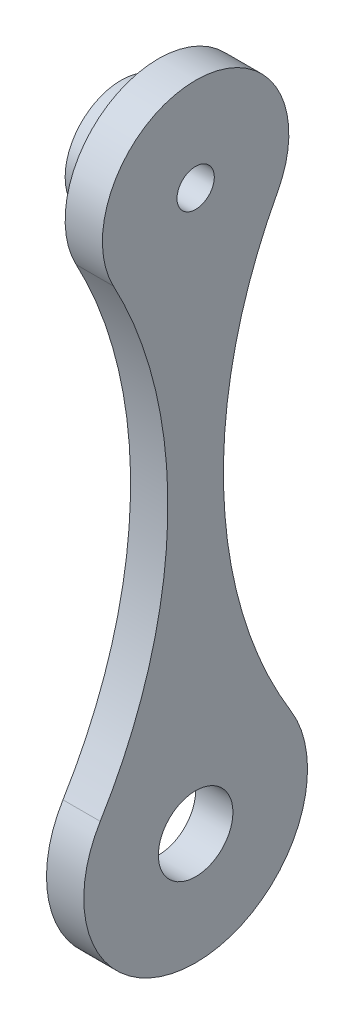
ISO-10303-21;
HEADER;
FILE_DESCRIPTION(('STEP AP214'),'2;1');
FILE_NAME('part.step','',(''),(''),'','','');
FILE_SCHEMA(('AUTOMOTIVE_DESIGN { 1 0 10303 214 1 1 1 1 }'));
ENDSEC;
DATA;
#1=APPLICATION_CONTEXT('core data for automotive mechanical design processes');
#2=APPLICATION_PROTOCOL_DEFINITION('international standard','automotive_design',2000,#1);
#3=PRODUCT_CONTEXT('',#1,'mechanical');
#4=PRODUCT('Part','Part','',(#3));
#5=PRODUCT_RELATED_PRODUCT_CATEGORY('part','',(#4));
#6=PRODUCT_DEFINITION_FORMATION('','',#4);
#7=PRODUCT_DEFINITION_CONTEXT('part definition',#1,'design');
#8=PRODUCT_DEFINITION('design','',#6,#7);
#9=PRODUCT_DEFINITION_SHAPE('','',#8);
#10=(LENGTH_UNIT() NAMED_UNIT(*) SI_UNIT(.MILLI.,.METRE.));
#11=(NAMED_UNIT(*) PLANE_ANGLE_UNIT() SI_UNIT($,.RADIAN.));
#12=(NAMED_UNIT(*) SI_UNIT($,.STERADIAN.) SOLID_ANGLE_UNIT());
#13=UNCERTAINTY_MEASURE_WITH_UNIT(LENGTH_MEASURE(1.E-05),#10,'distance_accuracy_value','');
#14=(GEOMETRIC_REPRESENTATION_CONTEXT(3) GLOBAL_UNCERTAINTY_ASSIGNED_CONTEXT((#13)) GLOBAL_UNIT_ASSIGNED_CONTEXT((#10,
#11,#12)) REPRESENTATION_CONTEXT('',''));
#15=CARTESIAN_POINT('',(0.,0.,0.));
#16=DIRECTION('',(0.,0.,1.));
#17=DIRECTION('',(1.,0.,0.));
#18=AXIS2_PLACEMENT_3D('',#15,#16,#17);
#19=CARTESIAN_POINT('',(10.,-80.,0.));
#20=DIRECTION('',(-1.,0.,0.));
#21=DIRECTION('',(0.,0.,1.));
#22=AXIS2_PLACEMENT_3D('',#19,#20,#21);
#23=CYLINDRICAL_SURFACE('',#22,25.);
#24=CARTESIAN_POINT('',(0.,-80.,0.));
#25=DIRECTION('',(1.,0.,0.));
#26=DIRECTION('',(0.,0.,-1.));
#27=AXIS2_PLACEMENT_3D('',#24,#25,#26);
#28=CIRCLE('',#27,25.);
#29=CARTESIAN_POINT('',(0.,-91.7990522807326,-22.0404710765569));
#30=VERTEX_POINT('',#29);
#31=CARTESIAN_POINT('',(0.,-91.7990522807326,22.0404710765569));
#32=VERTEX_POINT('',#31);
#33=EDGE_CURVE('E130',#30,#32,#28,.T.);
#34=ORIENTED_EDGE('',*,*,#33,.T.);
#35=DIRECTION('',(-1.,0.,0.));
#36=VECTOR('',#35,1.);
#37=CARTESIAN_POINT('',(10.,-91.7990522807326,22.0404710765569));
#38=LINE('',#37,#36);
#39=CARTESIAN_POINT('',(10.,-91.7990522807326,22.0404710765569));
#40=VERTEX_POINT('',#39);
#41=EDGE_CURVE('E128',#40,#32,#38,.T.);
#42=ORIENTED_EDGE('',*,*,#41,.F.);
#43=CARTESIAN_POINT('',(10.,-80.,0.));
#44=DIRECTION('',(1.,0.,0.));
#45=DIRECTION('',(0.,0.,-1.));
#46=AXIS2_PLACEMENT_3D('',#43,#44,#45);
#47=CIRCLE('',#46,25.);
#48=CARTESIAN_POINT('',(10.,-91.7990522807326,-22.0404710765569));
#49=VERTEX_POINT('',#48);
#50=EDGE_CURVE('E118',#49,#40,#47,.T.);
#51=ORIENTED_EDGE('',*,*,#50,.F.);
#52=DIRECTION('',(-1.,0.,0.));
#53=VECTOR('',#52,1.);
#54=CARTESIAN_POINT('',(10.,-91.7990522807326,-22.0404710765569));
#55=LINE('',#54,#53);
#56=EDGE_CURVE('E83',#49,#30,#55,.T.);
#57=ORIENTED_EDGE('',*,*,#56,.T.);
#58=EDGE_LOOP('',(#34,#42,#51,#57));
#59=FACE_BOUND('',#58,.T.);
#60=ADVANCED_FACE('F74',(#59),#23,.T.);
#61=CARTESIAN_POINT('',(10.,-149.97456329341,130.711543746744));
#62=DIRECTION('',(-1.,0.,0.));
#63=DIRECTION('',(0.,0.,1.));
#64=AXIS2_PLACEMENT_3D('',#61,#62,#63);
#65=CYLINDRICAL_SURFACE('',#64,123.263101197703);
#66=CARTESIAN_POINT('',(0.,-149.97456329341,130.711543746744));
#67=DIRECTION('',(1.,0.,0.));
#68=DIRECTION('',(0.,0.,-1.));
#69=AXIS2_PLACEMENT_3D('',#66,#67,#68);
#70=CIRCLE('',#69,123.263101197703);
#71=CARTESIAN_POINT('',(0.,-214.335674520243,25.5857168604721));
#72=VERTEX_POINT('',#71);
#73=EDGE_CURVE('E145',#32,#72,#70,.F.);
#74=ORIENTED_EDGE('',*,*,#73,.T.);
#75=DIRECTION('',(-1.,0.,0.));
#76=VECTOR('',#75,1.);
#77=CARTESIAN_POINT('',(10.,-214.335674520243,25.5857168604721));
#78=LINE('',#77,#76);
#79=CARTESIAN_POINT('',(10.,-214.335674520243,25.5857168604721));
#80=VERTEX_POINT('',#79);
#81=EDGE_CURVE('E105',#80,#72,#78,.T.);
#82=ORIENTED_EDGE('',*,*,#81,.F.);
#83=CARTESIAN_POINT('',(10.,-149.97456329341,130.711543746744));
#84=DIRECTION('',(1.,0.,0.));
#85=DIRECTION('',(0.,0.,-1.));
#86=AXIS2_PLACEMENT_3D('',#83,#84,#85);
#87=CIRCLE('',#86,123.263101197703);
#88=EDGE_CURVE('E123',#40,#80,#87,.F.);
#89=ORIENTED_EDGE('',*,*,#88,.F.);
#90=ORIENTED_EDGE('',*,*,#41,.T.);
#91=EDGE_LOOP('',(#74,#82,#89,#90));
#92=FACE_BOUND('',#91,.T.);
#93=ADVANCED_FACE('F135',(#92),#65,.F.);
#94=CARTESIAN_POINT('',(10.,-149.97456329341,-130.711543746744));
#95=DIRECTION('',(-1.,0.,0.));
#96=DIRECTION('',(0.,0.,1.));
#97=AXIS2_PLACEMENT_3D('',#94,#95,#96);
#98=CYLINDRICAL_SURFACE('',#97,123.263101197703);
#99=CARTESIAN_POINT('',(0.,-149.97456329341,-130.711543746744));
#100=DIRECTION('',(1.,0.,0.));
#101=DIRECTION('',(0.,0.,-1.));
#102=AXIS2_PLACEMENT_3D('',#99,#100,#101);
#103=CIRCLE('',#102,123.263101197703);
#104=CARTESIAN_POINT('',(0.,-214.335674520243,-25.5857168604721));
#105=VERTEX_POINT('',#104);
#106=EDGE_CURVE('E140',#30,#105,#103,.T.);
#107=ORIENTED_EDGE('',*,*,#106,.F.);
#108=ORIENTED_EDGE('',*,*,#56,.F.);
#109=CARTESIAN_POINT('',(10.,-149.97456329341,-130.711543746744));
#110=DIRECTION('',(1.,0.,0.));
#111=DIRECTION('',(0.,0.,-1.));
#112=AXIS2_PLACEMENT_3D('',#109,#110,#111);
#113=CIRCLE('',#112,123.263101197703);
#114=CARTESIAN_POINT('',(10.,-214.335674520243,-25.5857168604721));
#115=VERTEX_POINT('',#114);
#116=EDGE_CURVE('E124',#49,#115,#113,.T.);
#117=ORIENTED_EDGE('',*,*,#116,.T.);
#118=DIRECTION('',(-1.,0.,0.));
#119=VECTOR('',#118,1.);
#120=CARTESIAN_POINT('',(10.,-214.335674520243,-25.5857168604721));
#121=LINE('',#120,#119);
#122=EDGE_CURVE('E91',#115,#105,#121,.T.);
#123=ORIENTED_EDGE('',*,*,#122,.T.);
#124=EDGE_LOOP('',(#107,#108,#117,#123));
#125=FACE_BOUND('',#124,.T.);
#126=ADVANCED_FACE('F160',(#125),#98,.F.);
#127=CARTESIAN_POINT('',(0.,0.,0.));
#128=DIRECTION('',(1.,0.,0.));
#129=DIRECTION('',(0.,0.,-1.));
#130=AXIS2_PLACEMENT_3D('',#127,#128,#129);
#131=PLANE('',#130);
#132=CARTESIAN_POINT('',(0.,-80.,0.));
#133=DIRECTION('',(1.,0.,0.));
#134=DIRECTION('',(0.,0.,-1.));
#135=AXIS2_PLACEMENT_3D('',#132,#133,#134);
#136=CIRCLE('',#135,15.);
#137=CARTESIAN_POINT('',(0.,-80.,-15.));
#138=VERTEX_POINT('',#137);
#139=EDGE_CURVE('E12',#138,#138,#136,.F.);
#140=ORIENTED_EDGE('',*,*,#139,.F.);
#141=EDGE_LOOP('',(#140));
#142=FACE_BOUND('',#141,.T.);
#143=ORIENTED_EDGE('',*,*,#106,.T.);
#144=CARTESIAN_POINT('',(0.,-230.,0.));
#145=DIRECTION('',(1.,0.,0.));
#146=DIRECTION('',(0.,0.,-1.));
#147=AXIS2_PLACEMENT_3D('',#144,#145,#146);
#148=CIRCLE('',#147,30.);
#149=EDGE_CURVE('E152',#72,#105,#148,.T.);
#150=ORIENTED_EDGE('',*,*,#149,.F.);
#151=ORIENTED_EDGE('',*,*,#73,.F.);
#152=ORIENTED_EDGE('',*,*,#33,.F.);
#153=EDGE_LOOP('',(#143,#150,#151,#152));
#154=FACE_BOUND('',#153,.T.);
#155=CARTESIAN_POINT('',(0.,-230.,0.));
#156=DIRECTION('',(1.,0.,0.));
#157=DIRECTION('',(0.,0.,-1.));
#158=AXIS2_PLACEMENT_3D('',#155,#156,#157);
#159=CIRCLE('',#158,10.);
#160=CARTESIAN_POINT('',(0.,-230.,-10.));
#161=VERTEX_POINT('',#160);
#162=EDGE_CURVE('E153',#161,#161,#159,.T.);
#163=ORIENTED_EDGE('',*,*,#162,.T.);
#164=EDGE_LOOP('',(#163));
#165=FACE_BOUND('',#164,.T.);
#166=ADVANCED_FACE('F158',(#142,#154,#165),#131,.F.);
#167=CARTESIAN_POINT('',(10.,0.,0.));
#168=DIRECTION('',(1.,0.,0.));
#169=DIRECTION('',(0.,0.,-1.));
#170=AXIS2_PLACEMENT_3D('',#167,#168,#169);
#171=PLANE('',#170);
#172=CARTESIAN_POINT('',(10.,-80.,0.));
#173=DIRECTION('',(-1.,0.,0.));
#174=DIRECTION('',(0.,0.,1.));
#175=AXIS2_PLACEMENT_3D('',#172,#173,#174);
#176=CIRCLE('',#175,5.00000000000001);
#177=CARTESIAN_POINT('',(10.,-80.,5.00000000000001));
#178=VERTEX_POINT('',#177);
#179=EDGE_CURVE('E195',#178,#178,#176,.T.);
#180=ORIENTED_EDGE('',*,*,#179,.T.);
#181=EDGE_LOOP('',(#180));
#182=FACE_BOUND('',#181,.T.);
#183=ORIENTED_EDGE('',*,*,#116,.F.);
#184=ORIENTED_EDGE('',*,*,#50,.T.);
#185=ORIENTED_EDGE('',*,*,#88,.T.);
#186=CARTESIAN_POINT('',(10.,-230.,0.));
#187=DIRECTION('',(1.,0.,0.));
#188=DIRECTION('',(0.,0.,-1.));
#189=AXIS2_PLACEMENT_3D('',#186,#187,#188);
#190=CIRCLE('',#189,30.);
#191=EDGE_CURVE('E143',#80,#115,#190,.T.);
#192=ORIENTED_EDGE('',*,*,#191,.T.);
#193=EDGE_LOOP('',(#183,#184,#185,#192));
#194=FACE_BOUND('',#193,.T.);
#195=CARTESIAN_POINT('',(10.,-230.,0.));
#196=DIRECTION('',(1.,0.,0.));
#197=DIRECTION('',(0.,0.,-1.));
#198=AXIS2_PLACEMENT_3D('',#195,#196,#197);
#199=CIRCLE('',#198,10.);
#200=CARTESIAN_POINT('',(10.,-230.,-10.));
#201=VERTEX_POINT('',#200);
#202=EDGE_CURVE('E149',#201,#201,#199,.T.);
#203=ORIENTED_EDGE('',*,*,#202,.F.);
#204=EDGE_LOOP('',(#203));
#205=FACE_BOUND('',#204,.T.);
#206=ADVANCED_FACE('F120',(#182,#194,#205),#171,.T.);
#207=CARTESIAN_POINT('',(10.,-230.,0.));
#208=DIRECTION('',(-1.,0.,0.));
#209=DIRECTION('',(0.,0.,1.));
#210=AXIS2_PLACEMENT_3D('',#207,#208,#209);
#211=CYLINDRICAL_SURFACE('',#210,10.);
#212=ORIENTED_EDGE('',*,*,#202,.T.);
#213=EDGE_LOOP('',(#212));
#214=FACE_BOUND('',#213,.T.);
#215=ORIENTED_EDGE('',*,*,#162,.F.);
#216=EDGE_LOOP('',(#215));
#217=FACE_BOUND('',#216,.T.);
#218=ADVANCED_FACE('F177',(#214,#217),#211,.F.);
#219=CARTESIAN_POINT('',(10.,-230.,0.));
#220=DIRECTION('',(-1.,0.,0.));
#221=DIRECTION('',(0.,0.,1.));
#222=AXIS2_PLACEMENT_3D('',#219,#220,#221);
#223=CYLINDRICAL_SURFACE('',#222,30.);
#224=ORIENTED_EDGE('',*,*,#122,.F.);
#225=ORIENTED_EDGE('',*,*,#191,.F.);
#226=ORIENTED_EDGE('',*,*,#81,.T.);
#227=ORIENTED_EDGE('',*,*,#149,.T.);
#228=EDGE_LOOP('',(#224,#225,#226,#227));
#229=FACE_BOUND('',#228,.T.);
#230=ADVANCED_FACE('F76',(#229),#223,.T.);
#231=CARTESIAN_POINT('',(-10.,-80.,0.));
#232=DIRECTION('',(1.,0.,0.));
#233=DIRECTION('',(0.,0.,-1.));
#234=AXIS2_PLACEMENT_3D('',#231,#232,#233);
#235=CYLINDRICAL_SURFACE('',#234,15.);
#236=CARTESIAN_POINT('',(-10.,-80.,0.));
#237=DIRECTION('',(-1.,0.,0.));
#238=DIRECTION('',(0.,0.,1.));
#239=AXIS2_PLACEMENT_3D('',#236,#237,#238);
#240=CIRCLE('',#239,15.);
#241=CARTESIAN_POINT('',(-10.,-80.,15.));
#242=VERTEX_POINT('',#241);
#243=EDGE_CURVE('E156',#242,#242,#240,.T.);
#244=ORIENTED_EDGE('',*,*,#243,.F.);
#245=EDGE_LOOP('',(#244));
#246=FACE_BOUND('',#245,.T.);
#247=ORIENTED_EDGE('',*,*,#139,.T.);
#248=EDGE_LOOP('',(#247));
#249=FACE_BOUND('',#248,.T.);
#250=ADVANCED_FACE('F179',(#246,#249),#235,.T.);
#251=CARTESIAN_POINT('',(-10.,-80.,0.));
#252=DIRECTION('',(-1.,0.,0.));
#253=DIRECTION('',(0.,0.,1.));
#254=AXIS2_PLACEMENT_3D('',#251,#252,#253);
#255=PLANE('',#254);
#256=CARTESIAN_POINT('',(-10.,-80.,0.));
#257=DIRECTION('',(-1.,0.,0.));
#258=DIRECTION('',(0.,0.,1.));
#259=AXIS2_PLACEMENT_3D('',#256,#257,#258);
#260=CIRCLE('',#259,5.00000000000001);
#261=CARTESIAN_POINT('',(-10.,-80.,5.00000000000001));
#262=VERTEX_POINT('',#261);
#263=EDGE_CURVE('E198',#262,#262,#260,.T.);
#264=ORIENTED_EDGE('',*,*,#263,.F.);
#265=EDGE_LOOP('',(#264));
#266=FACE_BOUND('',#265,.T.);
#267=ORIENTED_EDGE('',*,*,#243,.T.);
#268=EDGE_LOOP('',(#267));
#269=FACE_BOUND('',#268,.T.);
#270=ADVANCED_FACE('F182',(#266,#269),#255,.T.);
#271=CARTESIAN_POINT('',(10.,-80.,0.));
#272=DIRECTION('',(-1.,0.,0.));
#273=DIRECTION('',(0.,0.,1.));
#274=AXIS2_PLACEMENT_3D('',#271,#272,#273);
#275=CYLINDRICAL_SURFACE('',#274,5.00000000000001);
#276=ORIENTED_EDGE('',*,*,#179,.F.);
#277=EDGE_LOOP('',(#276));
#278=FACE_BOUND('',#277,.T.);
#279=ORIENTED_EDGE('',*,*,#263,.T.);
#280=EDGE_LOOP('',(#279));
#281=FACE_BOUND('',#280,.T.);
#282=ADVANCED_FACE('F186',(#278,#281),#275,.F.);
#283=CLOSED_SHELL('',(#60,#93,#126,#166,#206,#218,#230,#250,#270,#282));
#284=MANIFOLD_SOLID_BREP('B2',#283);
#285=ADVANCED_BREP_SHAPE_REPRESENTATION('',(#18,#284),#14);
#286=SHAPE_DEFINITION_REPRESENTATION(#9,#285);
ENDSEC;
END-ISO-10303-21;
